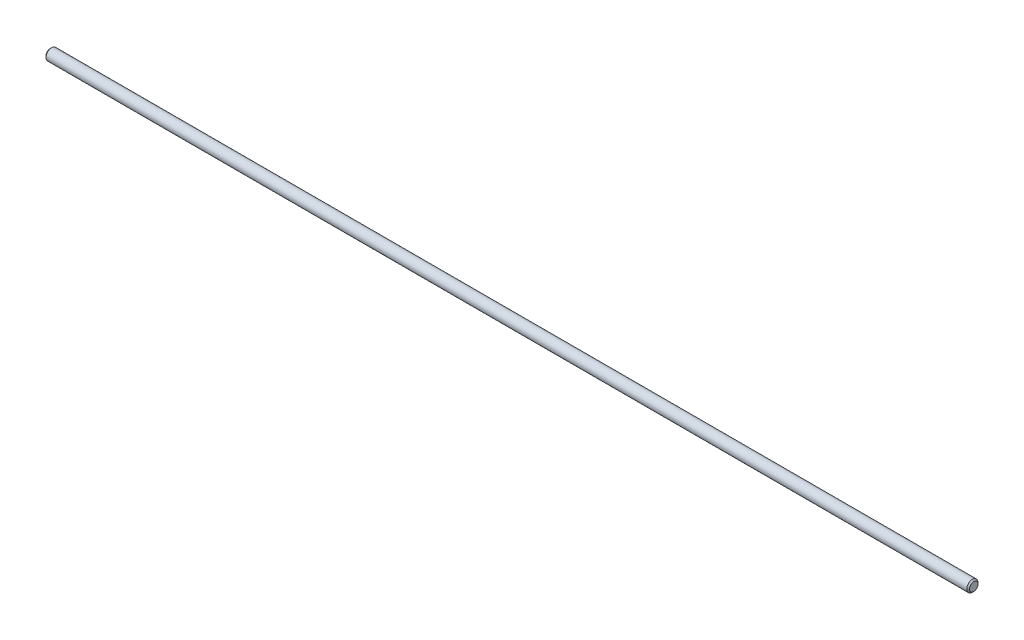
ISO-10303-21;
HEADER;
FILE_DESCRIPTION(('STEP AP214'),'2;1');
FILE_NAME('part.step','',(''),(''),'','','');
FILE_SCHEMA(('AUTOMOTIVE_DESIGN { 1 0 10303 214 1 1 1 1 }'));
ENDSEC;
DATA;
#1=APPLICATION_CONTEXT('core data for automotive mechanical design processes');
#2=APPLICATION_PROTOCOL_DEFINITION('international standard','automotive_design',2000,#1);
#3=PRODUCT_CONTEXT('',#1,'mechanical');
#4=PRODUCT('Part','Part','',(#3));
#5=PRODUCT_RELATED_PRODUCT_CATEGORY('part','',(#4));
#6=PRODUCT_DEFINITION_FORMATION('','',#4);
#7=PRODUCT_DEFINITION_CONTEXT('part definition',#1,'design');
#8=PRODUCT_DEFINITION('design','',#6,#7);
#9=PRODUCT_DEFINITION_SHAPE('','',#8);
#10=(LENGTH_UNIT() NAMED_UNIT(*) SI_UNIT(.MILLI.,.METRE.));
#11=(NAMED_UNIT(*) PLANE_ANGLE_UNIT() SI_UNIT($,.RADIAN.));
#12=(NAMED_UNIT(*) SI_UNIT($,.STERADIAN.) SOLID_ANGLE_UNIT());
#13=UNCERTAINTY_MEASURE_WITH_UNIT(LENGTH_MEASURE(1.E-05),#10,'distance_accuracy_value','');
#14=(GEOMETRIC_REPRESENTATION_CONTEXT(3) GLOBAL_UNCERTAINTY_ASSIGNED_CONTEXT((#13)) GLOBAL_UNIT_ASSIGNED_CONTEXT((#10,
#11,#12)) REPRESENTATION_CONTEXT('',''));
#15=CARTESIAN_POINT('',(0.,0.,0.));
#16=DIRECTION('',(0.,0.,1.));
#17=DIRECTION('',(1.,0.,0.));
#18=AXIS2_PLACEMENT_3D('',#15,#16,#17);
#19=CARTESIAN_POINT('',(-82.175,0.,0.));
#20=DIRECTION('',(1.,0.,0.));
#21=DIRECTION('',(0.,0.,-1.));
#22=AXIS2_PLACEMENT_3D('',#19,#20,#21);
#23=CYLINDRICAL_SURFACE('',#22,1.);
#24=CARTESIAN_POINT('',(-81.9275641703473,0.,0.));
#25=DIRECTION('',(1.,0.,0.));
#26=DIRECTION('',(0.,0.,-1.));
#27=AXIS2_PLACEMENT_3D('',#24,#25,#26);
#28=CIRCLE('',#27,1.);
#29=CARTESIAN_POINT('',(-81.9275641703473,0.,-1.));
#30=VERTEX_POINT('',#29);
#31=EDGE_CURVE('E45',#30,#30,#28,.F.);
#32=ORIENTED_EDGE('',*,*,#31,.F.);
#33=EDGE_LOOP('',(#32));
#34=FACE_BOUND('',#33,.T.);
#35=CARTESIAN_POINT('',(81.9275641703473,0.,0.));
#36=DIRECTION('',(-1.,0.,0.));
#37=DIRECTION('',(0.,0.,1.));
#38=AXIS2_PLACEMENT_3D('',#35,#36,#37);
#39=CIRCLE('',#38,1.);
#40=CARTESIAN_POINT('',(81.9275641703473,0.,1.));
#41=VERTEX_POINT('',#40);
#42=EDGE_CURVE('E11',#41,#41,#39,.T.);
#43=ORIENTED_EDGE('',*,*,#42,.T.);
#44=EDGE_LOOP('',(#43));
#45=FACE_BOUND('',#44,.T.);
#46=ADVANCED_FACE('F35',(#34,#45),#23,.T.);
#47=CARTESIAN_POINT('',(82.175,0.,0.));
#48=DIRECTION('',(-1.,0.,0.));
#49=DIRECTION('',(0.,0.,-1.));
#50=AXIS2_PLACEMENT_3D('',#47,#48,#49);
#51=CONICAL_SURFACE('',#50,0.752564170347313,0.78539816339745);
#52=ORIENTED_EDGE('',*,*,#42,.F.);
#53=EDGE_LOOP('',(#52));
#54=FACE_BOUND('',#53,.T.);
#55=CARTESIAN_POINT('',(82.175,0.,0.));
#56=DIRECTION('',(1.,0.,0.));
#57=DIRECTION('',(0.,0.,-1.));
#58=AXIS2_PLACEMENT_3D('',#55,#56,#57);
#59=CIRCLE('',#58,0.752564170347313);
#60=CARTESIAN_POINT('',(82.175,0.,-0.752564170347313));
#61=VERTEX_POINT('',#60);
#62=EDGE_CURVE('E41',#61,#61,#59,.T.);
#63=ORIENTED_EDGE('',*,*,#62,.F.);
#64=EDGE_LOOP('',(#63));
#65=FACE_BOUND('',#64,.T.);
#66=ADVANCED_FACE('F67',(#54,#65),#51,.T.);
#67=CARTESIAN_POINT('',(82.175,0.,0.));
#68=DIRECTION('',(1.,0.,0.));
#69=DIRECTION('',(0.,0.,-1.));
#70=AXIS2_PLACEMENT_3D('',#67,#68,#69);
#71=PLANE('',#70);
#72=ORIENTED_EDGE('',*,*,#62,.T.);
#73=EDGE_LOOP('',(#72));
#74=FACE_BOUND('',#73,.T.);
#75=ADVANCED_FACE('F62',(#74),#71,.T.);
#76=CARTESIAN_POINT('',(-82.175,0.,0.));
#77=DIRECTION('',(1.,0.,0.));
#78=DIRECTION('',(0.,0.,-1.));
#79=AXIS2_PLACEMENT_3D('',#76,#77,#78);
#80=CONICAL_SURFACE('',#79,0.752564170347313,0.78539816339745);
#81=ORIENTED_EDGE('',*,*,#31,.T.);
#82=EDGE_LOOP('',(#81));
#83=FACE_BOUND('',#82,.T.);
#84=CARTESIAN_POINT('',(-82.175,0.,0.));
#85=DIRECTION('',(1.,0.,0.));
#86=DIRECTION('',(0.,0.,-1.));
#87=AXIS2_PLACEMENT_3D('',#84,#85,#86);
#88=CIRCLE('',#87,0.752564170347313);
#89=CARTESIAN_POINT('',(-82.175,0.,-0.752564170347313));
#90=VERTEX_POINT('',#89);
#91=EDGE_CURVE('E49',#90,#90,#88,.T.);
#92=ORIENTED_EDGE('',*,*,#91,.T.);
#93=EDGE_LOOP('',(#92));
#94=FACE_BOUND('',#93,.T.);
#95=ADVANCED_FACE('F55',(#83,#94),#80,.T.);
#96=CARTESIAN_POINT('',(-82.175,0.,0.));
#97=DIRECTION('',(1.,0.,0.));
#98=DIRECTION('',(0.,0.,-1.));
#99=AXIS2_PLACEMENT_3D('',#96,#97,#98);
#100=PLANE('',#99);
#101=ORIENTED_EDGE('',*,*,#91,.F.);
#102=EDGE_LOOP('',(#101));
#103=FACE_BOUND('',#102,.T.);
#104=ADVANCED_FACE('F57',(#103),#100,.F.);
#105=CLOSED_SHELL('',(#46,#66,#75,#95,#104));
#106=MANIFOLD_SOLID_BREP('B2',#105);
#107=ADVANCED_BREP_SHAPE_REPRESENTATION('',(#18,#106),#14);
#108=SHAPE_DEFINITION_REPRESENTATION(#9,#107);
ENDSEC;
END-ISO-10303-21;
